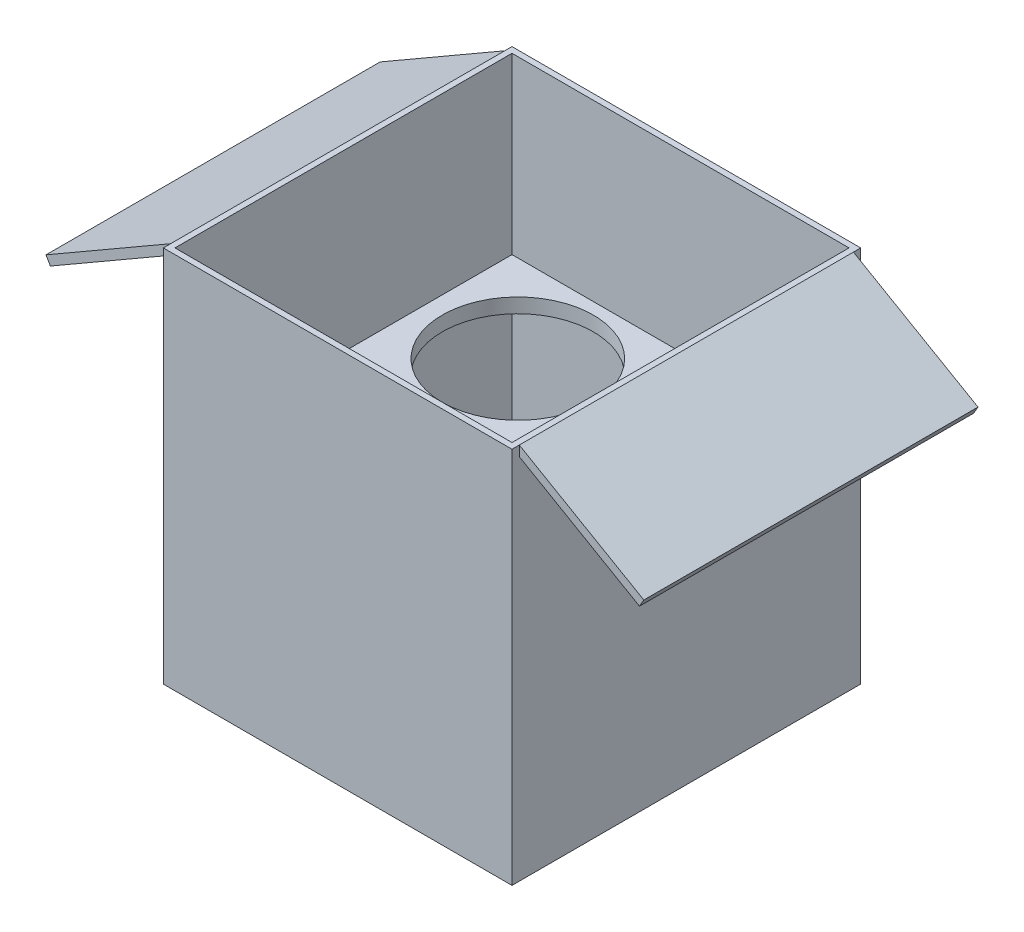
ISO-10303-21;
HEADER;
FILE_DESCRIPTION(('STEP AP214'),'2;1');
FILE_NAME('part.step','',(''),(''),'','','');
FILE_SCHEMA(('AUTOMOTIVE_DESIGN { 1 0 10303 214 1 1 1 1 }'));
ENDSEC;
DATA;
#1=APPLICATION_CONTEXT('core data for automotive mechanical design processes');
#2=APPLICATION_PROTOCOL_DEFINITION('international standard','automotive_design',2000,#1);
#3=PRODUCT_CONTEXT('',#1,'mechanical');
#4=PRODUCT('Part','Part','',(#3));
#5=PRODUCT_RELATED_PRODUCT_CATEGORY('part','',(#4));
#6=PRODUCT_DEFINITION_FORMATION('','',#4);
#7=PRODUCT_DEFINITION_CONTEXT('part definition',#1,'design');
#8=PRODUCT_DEFINITION('design','',#6,#7);
#9=PRODUCT_DEFINITION_SHAPE('','',#8);
#10=(LENGTH_UNIT() NAMED_UNIT(*) SI_UNIT(.MILLI.,.METRE.));
#11=(NAMED_UNIT(*) PLANE_ANGLE_UNIT() SI_UNIT($,.RADIAN.));
#12=(NAMED_UNIT(*) SI_UNIT($,.STERADIAN.) SOLID_ANGLE_UNIT());
#13=UNCERTAINTY_MEASURE_WITH_UNIT(LENGTH_MEASURE(1.E-05),#10,'distance_accuracy_value','');
#14=(GEOMETRIC_REPRESENTATION_CONTEXT(3) GLOBAL_UNCERTAINTY_ASSIGNED_CONTEXT((#13)) GLOBAL_UNIT_ASSIGNED_CONTEXT((#10,
#11,#12)) REPRESENTATION_CONTEXT('',''));
#15=CARTESIAN_POINT('',(0.,0.,0.));
#16=DIRECTION('',(0.,0.,1.));
#17=DIRECTION('',(1.,0.,0.));
#18=AXIS2_PLACEMENT_3D('',#15,#16,#17);
#19=CARTESIAN_POINT('',(0.,5.,0.));
#20=DIRECTION('',(0.,1.,0.));
#21=DIRECTION('',(0.,0.,1.));
#22=AXIS2_PLACEMENT_3D('',#19,#20,#21);
#23=PLANE('',#22);
#24=DIRECTION('',(0.,0.,-1.));
#25=VECTOR('',#24,1.);
#26=CARTESIAN_POINT('',(-58.,5.,0.));
#27=LINE('',#26,#25);
#28=CARTESIAN_POINT('',(-58.,5.,58.));
#29=VERTEX_POINT('',#28);
#30=CARTESIAN_POINT('',(-58.,5.,-58.));
#31=VERTEX_POINT('',#30);
#32=EDGE_CURVE('E215',#29,#31,#27,.T.);
#33=ORIENTED_EDGE('',*,*,#32,.F.);
#34=DIRECTION('',(-1.,0.,0.));
#35=VECTOR('',#34,1.);
#36=CARTESIAN_POINT('',(0.,5.,58.));
#37=LINE('',#36,#35);
#38=CARTESIAN_POINT('',(58.,5.,58.));
#39=VERTEX_POINT('',#38);
#40=EDGE_CURVE('E306',#39,#29,#37,.T.);
#41=ORIENTED_EDGE('',*,*,#40,.F.);
#42=DIRECTION('',(0.,0.,1.));
#43=VECTOR('',#42,1.);
#44=CARTESIAN_POINT('',(58.,5.,0.));
#45=LINE('',#44,#43);
#46=CARTESIAN_POINT('',(58.,5.,-58.));
#47=VERTEX_POINT('',#46);
#48=EDGE_CURVE('E302',#47,#39,#45,.T.);
#49=ORIENTED_EDGE('',*,*,#48,.F.);
#50=DIRECTION('',(1.,0.,0.));
#51=VECTOR('',#50,1.);
#52=CARTESIAN_POINT('',(0.,5.,-58.));
#53=LINE('',#52,#51);
#54=EDGE_CURVE('E298',#31,#47,#53,.T.);
#55=ORIENTED_EDGE('',*,*,#54,.F.);
#56=EDGE_LOOP('',(#33,#41,#49,#55));
#57=FACE_BOUND('',#56,.T.);
#58=ADVANCED_FACE('F71',(#57),#23,.T.);
#59=CARTESIAN_POINT('',(-58.,130.,-58.));
#60=DIRECTION('',(0.,0.,1.));
#61=DIRECTION('',(1.,0.,0.));
#62=AXIS2_PLACEMENT_3D('',#59,#60,#61);
#63=PLANE('',#62);
#64=DIRECTION('',(0.,-1.,0.));
#65=VECTOR('',#64,1.);
#66=CARTESIAN_POINT('',(58.,130.,-58.));
#67=LINE('',#66,#65);
#68=CARTESIAN_POINT('',(58.,65.,-58.));
#69=VERTEX_POINT('',#68);
#70=EDGE_CURVE('E233',#69,#47,#67,.T.);
#71=ORIENTED_EDGE('',*,*,#70,.F.);
#72=DIRECTION('',(-1.,0.,0.));
#73=VECTOR('',#72,1.);
#74=CARTESIAN_POINT('',(-58.,65.,-58.));
#75=LINE('',#74,#73);
#76=CARTESIAN_POINT('',(-58.,65.,-58.));
#77=VERTEX_POINT('',#76);
#78=EDGE_CURVE('E12',#69,#77,#75,.T.);
#79=ORIENTED_EDGE('',*,*,#78,.T.);
#80=DIRECTION('',(0.,-1.,0.));
#81=VECTOR('',#80,1.);
#82=CARTESIAN_POINT('',(-58.,130.,-58.));
#83=LINE('',#82,#81);
#84=EDGE_CURVE('E234',#77,#31,#83,.T.);
#85=ORIENTED_EDGE('',*,*,#84,.T.);
#86=ORIENTED_EDGE('',*,*,#54,.T.);
#87=EDGE_LOOP('',(#71,#79,#85,#86));
#88=FACE_BOUND('',#87,.T.);
#89=ADVANCED_FACE('F467',(#88),#63,.T.);
#90=CARTESIAN_POINT('',(58.,130.,-58.));
#91=DIRECTION('',(-1.,0.,0.));
#92=DIRECTION('',(0.,0.,1.));
#93=AXIS2_PLACEMENT_3D('',#90,#91,#92);
#94=PLANE('',#93);
#95=DIRECTION('',(0.,-1.,0.));
#96=VECTOR('',#95,1.);
#97=CARTESIAN_POINT('',(58.,130.,58.));
#98=LINE('',#97,#96);
#99=CARTESIAN_POINT('',(58.,65.,58.));
#100=VERTEX_POINT('',#99);
#101=EDGE_CURVE('E244',#100,#39,#98,.T.);
#102=ORIENTED_EDGE('',*,*,#101,.F.);
#103=DIRECTION('',(0.,0.,-1.));
#104=VECTOR('',#103,1.);
#105=CARTESIAN_POINT('',(58.,65.,-58.));
#106=LINE('',#105,#104);
#107=EDGE_CURVE('E226',#100,#69,#106,.T.);
#108=ORIENTED_EDGE('',*,*,#107,.T.);
#109=ORIENTED_EDGE('',*,*,#70,.T.);
#110=ORIENTED_EDGE('',*,*,#48,.T.);
#111=EDGE_LOOP('',(#102,#108,#109,#110));
#112=FACE_BOUND('',#111,.T.);
#113=ADVANCED_FACE('F460',(#112),#94,.T.);
#114=CARTESIAN_POINT('',(-58.,130.,58.));
#115=DIRECTION('',(0.,0.,-1.));
#116=DIRECTION('',(-1.,0.,0.));
#117=AXIS2_PLACEMENT_3D('',#114,#115,#116);
#118=PLANE('',#117);
#119=DIRECTION('',(0.,-1.,0.));
#120=VECTOR('',#119,1.);
#121=CARTESIAN_POINT('',(-58.,130.,58.));
#122=LINE('',#121,#120);
#123=CARTESIAN_POINT('',(-58.,65.,58.));
#124=VERTEX_POINT('',#123);
#125=EDGE_CURVE('E249',#124,#29,#122,.T.);
#126=ORIENTED_EDGE('',*,*,#125,.F.);
#127=DIRECTION('',(1.,0.,0.));
#128=VECTOR('',#127,1.);
#129=CARTESIAN_POINT('',(-58.,65.,58.));
#130=LINE('',#129,#128);
#131=EDGE_CURVE('E342',#124,#100,#130,.T.);
#132=ORIENTED_EDGE('',*,*,#131,.T.);
#133=ORIENTED_EDGE('',*,*,#101,.T.);
#134=ORIENTED_EDGE('',*,*,#40,.T.);
#135=EDGE_LOOP('',(#126,#132,#133,#134));
#136=FACE_BOUND('',#135,.T.);
#137=ADVANCED_FACE('F454',(#136),#118,.T.);
#138=CARTESIAN_POINT('',(-58.,130.,-58.));
#139=DIRECTION('',(1.,0.,0.));
#140=DIRECTION('',(0.,0.,-1.));
#141=AXIS2_PLACEMENT_3D('',#138,#139,#140);
#142=PLANE('',#141);
#143=ORIENTED_EDGE('',*,*,#84,.F.);
#144=DIRECTION('',(0.,0.,1.));
#145=VECTOR('',#144,1.);
#146=CARTESIAN_POINT('',(-58.,65.,-58.));
#147=LINE('',#146,#145);
#148=EDGE_CURVE('E97',#77,#124,#147,.T.);
#149=ORIENTED_EDGE('',*,*,#148,.T.);
#150=ORIENTED_EDGE('',*,*,#125,.T.);
#151=ORIENTED_EDGE('',*,*,#32,.T.);
#152=EDGE_LOOP('',(#143,#149,#150,#151));
#153=FACE_BOUND('',#152,.T.);
#154=ADVANCED_FACE('F463',(#153),#142,.T.);
#155=CARTESIAN_POINT('',(-60.,65.,180.104121494643));
#156=DIRECTION('',(0.,1.,0.));
#157=DIRECTION('',(0.,0.,1.));
#158=AXIS2_PLACEMENT_3D('',#155,#156,#157);
#159=PLANE('',#158);
#160=CARTESIAN_POINT('',(-26.,65.,-28.));
#161=DIRECTION('',(0.,1.,0.));
#162=DIRECTION('',(0.,0.,1.));
#163=AXIS2_PLACEMENT_3D('',#160,#161,#162);
#164=CIRCLE('',#163,26.);
#165=CARTESIAN_POINT('',(-26.,65.,-2.00000000000001));
#166=VERTEX_POINT('',#165);
#167=EDGE_CURVE('E75',#166,#166,#164,.T.);
#168=ORIENTED_EDGE('',*,*,#167,.T.);
#169=EDGE_LOOP('',(#168));
#170=FACE_BOUND('',#169,.T.);
#171=CARTESIAN_POINT('',(28.,65.,28.));
#172=DIRECTION('',(0.,1.,0.));
#173=DIRECTION('',(0.,0.,1.));
#174=AXIS2_PLACEMENT_3D('',#171,#172,#173);
#175=CIRCLE('',#174,26.);
#176=CARTESIAN_POINT('',(28.,65.,54.));
#177=VERTEX_POINT('',#176);
#178=EDGE_CURVE('E321',#177,#177,#175,.T.);
#179=ORIENTED_EDGE('',*,*,#178,.T.);
#180=EDGE_LOOP('',(#179));
#181=FACE_BOUND('',#180,.T.);
#182=CARTESIAN_POINT('',(-26.,65.,28.));
#183=DIRECTION('',(0.,1.,0.));
#184=DIRECTION('',(0.,0.,1.));
#185=AXIS2_PLACEMENT_3D('',#182,#183,#184);
#186=CIRCLE('',#185,26.);
#187=CARTESIAN_POINT('',(-26.,65.,54.));
#188=VERTEX_POINT('',#187);
#189=EDGE_CURVE('E317',#188,#188,#186,.T.);
#190=ORIENTED_EDGE('',*,*,#189,.T.);
#191=EDGE_LOOP('',(#190));
#192=FACE_BOUND('',#191,.T.);
#193=CARTESIAN_POINT('',(28.,65.,-28.));
#194=DIRECTION('',(0.,1.,0.));
#195=DIRECTION('',(0.,0.,1.));
#196=AXIS2_PLACEMENT_3D('',#193,#194,#195);
#197=CIRCLE('',#196,26.);
#198=CARTESIAN_POINT('',(28.,65.,-2.00000000000002));
#199=VERTEX_POINT('',#198);
#200=EDGE_CURVE('E313',#199,#199,#197,.T.);
#201=ORIENTED_EDGE('',*,*,#200,.T.);
#202=EDGE_LOOP('',(#201));
#203=FACE_BOUND('',#202,.T.);
#204=ORIENTED_EDGE('',*,*,#148,.F.);
#205=ORIENTED_EDGE('',*,*,#78,.F.);
#206=ORIENTED_EDGE('',*,*,#107,.F.);
#207=ORIENTED_EDGE('',*,*,#131,.F.);
#208=EDGE_LOOP('',(#204,#205,#206,#207));
#209=FACE_BOUND('',#208,.T.);
#210=ADVANCED_FACE('F525',(#170,#181,#192,#203,#209),#159,.F.);
#211=CARTESIAN_POINT('',(28.,60.,-28.));
#212=DIRECTION('',(0.,1.,0.));
#213=DIRECTION('',(0.,0.,1.));
#214=AXIS2_PLACEMENT_3D('',#211,#212,#213);
#215=CYLINDRICAL_SURFACE('',#214,26.);
#216=CARTESIAN_POINT('',(28.,70.,-28.));
#217=DIRECTION('',(0.,1.,0.));
#218=DIRECTION('',(0.,0.,1.));
#219=AXIS2_PLACEMENT_3D('',#216,#217,#218);
#220=CIRCLE('',#219,26.);
#221=CARTESIAN_POINT('',(28.,70.,-2.00000000000002));
#222=VERTEX_POINT('',#221);
#223=EDGE_CURVE('E318',#222,#222,#220,.T.);
#224=ORIENTED_EDGE('',*,*,#223,.T.);
#225=EDGE_LOOP('',(#224));
#226=FACE_BOUND('',#225,.T.);
#227=ORIENTED_EDGE('',*,*,#200,.F.);
#228=EDGE_LOOP('',(#227));
#229=FACE_BOUND('',#228,.T.);
#230=ADVANCED_FACE('F529',(#226,#229),#215,.F.);
#231=CARTESIAN_POINT('',(-26.,60.,28.));
#232=DIRECTION('',(0.,1.,0.));
#233=DIRECTION('',(0.,0.,1.));
#234=AXIS2_PLACEMENT_3D('',#231,#232,#233);
#235=CYLINDRICAL_SURFACE('',#234,26.);
#236=CARTESIAN_POINT('',(-26.,70.,28.));
#237=DIRECTION('',(0.,1.,0.));
#238=DIRECTION('',(0.,0.,-1.));
#239=AXIS2_PLACEMENT_3D('',#236,#237,#238);
#240=CIRCLE('',#239,26.);
#241=CARTESIAN_POINT('',(-26.,70.,2.00000000000001));
#242=VERTEX_POINT('',#241);
#243=EDGE_CURVE('E916',#242,#242,#240,.T.);
#244=ORIENTED_EDGE('',*,*,#243,.T.);
#245=EDGE_LOOP('',(#244));
#246=FACE_BOUND('',#245,.T.);
#247=ORIENTED_EDGE('',*,*,#189,.F.);
#248=EDGE_LOOP('',(#247));
#249=FACE_BOUND('',#248,.T.);
#250=ADVANCED_FACE('F534',(#246,#249),#235,.F.);
#251=CARTESIAN_POINT('',(28.,60.,28.));
#252=DIRECTION('',(0.,1.,0.));
#253=DIRECTION('',(0.,0.,1.));
#254=AXIS2_PLACEMENT_3D('',#251,#252,#253);
#255=CYLINDRICAL_SURFACE('',#254,26.);
#256=CARTESIAN_POINT('',(28.,70.,28.));
#257=DIRECTION('',(0.,1.,0.));
#258=DIRECTION('',(0.,0.,-1.));
#259=AXIS2_PLACEMENT_3D('',#256,#257,#258);
#260=CIRCLE('',#259,26.);
#261=CARTESIAN_POINT('',(28.,70.,2.00000000000002));
#262=VERTEX_POINT('',#261);
#263=EDGE_CURVE('E910',#262,#262,#260,.T.);
#264=ORIENTED_EDGE('',*,*,#263,.T.);
#265=EDGE_LOOP('',(#264));
#266=FACE_BOUND('',#265,.T.);
#267=ORIENTED_EDGE('',*,*,#178,.F.);
#268=EDGE_LOOP('',(#267));
#269=FACE_BOUND('',#268,.T.);
#270=ADVANCED_FACE('F613',(#266,#269),#255,.F.);
#271=CARTESIAN_POINT('',(-26.,60.,-28.));
#272=DIRECTION('',(0.,1.,0.));
#273=DIRECTION('',(0.,0.,1.));
#274=AXIS2_PLACEMENT_3D('',#271,#272,#273);
#275=CYLINDRICAL_SURFACE('',#274,26.);
#276=CARTESIAN_POINT('',(-26.,70.,-28.));
#277=DIRECTION('',(0.,1.,0.));
#278=DIRECTION('',(0.,0.,1.));
#279=AXIS2_PLACEMENT_3D('',#276,#277,#278);
#280=CIRCLE('',#279,26.);
#281=CARTESIAN_POINT('',(-26.,70.,-2.00000000000001));
#282=VERTEX_POINT('',#281);
#283=EDGE_CURVE('E908',#282,#282,#280,.T.);
#284=ORIENTED_EDGE('',*,*,#283,.T.);
#285=EDGE_LOOP('',(#284));
#286=FACE_BOUND('',#285,.T.);
#287=ORIENTED_EDGE('',*,*,#167,.F.);
#288=EDGE_LOOP('',(#287));
#289=FACE_BOUND('',#288,.T.);
#290=ADVANCED_FACE('F461',(#286,#289),#275,.F.);
#291=CARTESIAN_POINT('',(-58.,130.,58.));
#292=VERTEX_POINT('',#291);
#293=CARTESIAN_POINT('',(-58.,70.,58.));
#294=VERTEX_POINT('',#293);
#295=EDGE_CURVE('E224',#292,#294,#122,.T.);
#296=ORIENTED_EDGE('',*,*,#295,.T.);
#297=DIRECTION('',(0.,0.,-1.));
#298=VECTOR('',#297,1.);
#299=CARTESIAN_POINT('',(-58.,70.,-58.));
#300=LINE('',#299,#298);
#301=CARTESIAN_POINT('',(-58.,70.,-58.));
#302=VERTEX_POINT('',#301);
#303=EDGE_CURVE('E209',#294,#302,#300,.T.);
#304=ORIENTED_EDGE('',*,*,#303,.T.);
#305=CARTESIAN_POINT('',(-58.,130.,-58.));
#306=VERTEX_POINT('',#305);
#307=EDGE_CURVE('E221',#306,#302,#83,.T.);
#308=ORIENTED_EDGE('',*,*,#307,.F.);
#309=DIRECTION('',(0.,0.,1.));
#310=VECTOR('',#309,1.);
#311=CARTESIAN_POINT('',(-58.,130.,-58.));
#312=LINE('',#311,#310);
#313=EDGE_CURVE('E436',#306,#292,#312,.T.);
#314=ORIENTED_EDGE('',*,*,#313,.T.);
#315=EDGE_LOOP('',(#296,#304,#308,#314));
#316=FACE_BOUND('',#315,.T.);
#317=ADVANCED_FACE('F220',(#316),#142,.T.);
#318=CARTESIAN_POINT('',(58.,130.,58.));
#319=VERTEX_POINT('',#318);
#320=CARTESIAN_POINT('',(58.,70.,58.));
#321=VERTEX_POINT('',#320);
#322=EDGE_CURVE('E245',#319,#321,#98,.T.);
#323=ORIENTED_EDGE('',*,*,#322,.T.);
#324=DIRECTION('',(-1.,0.,0.));
#325=VECTOR('',#324,1.);
#326=CARTESIAN_POINT('',(-58.,70.,58.));
#327=LINE('',#326,#325);
#328=EDGE_CURVE('E227',#321,#294,#327,.T.);
#329=ORIENTED_EDGE('',*,*,#328,.T.);
#330=ORIENTED_EDGE('',*,*,#295,.F.);
#331=DIRECTION('',(1.,0.,0.));
#332=VECTOR('',#331,1.);
#333=CARTESIAN_POINT('',(-58.,130.,58.));
#334=LINE('',#333,#332);
#335=EDGE_CURVE('E439',#292,#319,#334,.T.);
#336=ORIENTED_EDGE('',*,*,#335,.T.);
#337=EDGE_LOOP('',(#323,#329,#330,#336));
#338=FACE_BOUND('',#337,.T.);
#339=ADVANCED_FACE('F451',(#338),#118,.T.);
#340=CARTESIAN_POINT('',(58.,130.,-58.));
#341=VERTEX_POINT('',#340);
#342=CARTESIAN_POINT('',(58.,70.,-58.));
#343=VERTEX_POINT('',#342);
#344=EDGE_CURVE('E238',#341,#343,#67,.T.);
#345=ORIENTED_EDGE('',*,*,#344,.T.);
#346=DIRECTION('',(0.,0.,1.));
#347=VECTOR('',#346,1.);
#348=CARTESIAN_POINT('',(58.,70.,-58.));
#349=LINE('',#348,#347);
#350=EDGE_CURVE('E89',#343,#321,#349,.T.);
#351=ORIENTED_EDGE('',*,*,#350,.T.);
#352=ORIENTED_EDGE('',*,*,#322,.F.);
#353=DIRECTION('',(0.,0.,-1.));
#354=VECTOR('',#353,1.);
#355=CARTESIAN_POINT('',(58.,130.,-58.));
#356=LINE('',#355,#354);
#357=EDGE_CURVE('E441',#319,#341,#356,.T.);
#358=ORIENTED_EDGE('',*,*,#357,.T.);
#359=EDGE_LOOP('',(#345,#351,#352,#358));
#360=FACE_BOUND('',#359,.T.);
#361=ADVANCED_FACE('F446',(#360),#94,.T.);
#362=ORIENTED_EDGE('',*,*,#307,.T.);
#363=DIRECTION('',(1.,0.,0.));
#364=VECTOR('',#363,1.);
#365=CARTESIAN_POINT('',(-58.,70.,-58.));
#366=LINE('',#365,#364);
#367=EDGE_CURVE('E81',#302,#343,#366,.T.);
#368=ORIENTED_EDGE('',*,*,#367,.T.);
#369=ORIENTED_EDGE('',*,*,#344,.F.);
#370=DIRECTION('',(-1.,0.,0.));
#371=VECTOR('',#370,1.);
#372=CARTESIAN_POINT('',(-58.,130.,-58.));
#373=LINE('',#372,#371);
#374=EDGE_CURVE('E231',#341,#306,#373,.T.);
#375=ORIENTED_EDGE('',*,*,#374,.T.);
#376=EDGE_LOOP('',(#362,#368,#369,#375));
#377=FACE_BOUND('',#376,.T.);
#378=ADVANCED_FACE('F229',(#377),#63,.T.);
#379=CARTESIAN_POINT('',(-60.,5.,0.));
#380=DIRECTION('',(1.,0.,0.));
#381=DIRECTION('',(0.,0.,-1.));
#382=AXIS2_PLACEMENT_3D('',#379,#380,#381);
#383=PLANE('',#382);
#384=DIRECTION('',(0.,0.,1.));
#385=VECTOR('',#384,1.);
#386=CARTESIAN_POINT('',(-60.,0.,0.));
#387=LINE('',#386,#385);
#388=CARTESIAN_POINT('',(-60.,0.,-60.));
#389=VERTEX_POINT('',#388);
#390=CARTESIAN_POINT('',(-60.,0.,60.));
#391=VERTEX_POINT('',#390);
#392=EDGE_CURVE('E278',#389,#391,#387,.T.);
#393=ORIENTED_EDGE('',*,*,#392,.T.);
#394=DIRECTION('',(0.,-1.,0.));
#395=VECTOR('',#394,1.);
#396=CARTESIAN_POINT('',(-60.,5.,60.));
#397=LINE('',#396,#395);
#398=CARTESIAN_POINT('',(-60.,130.,60.));
#399=VERTEX_POINT('',#398);
#400=EDGE_CURVE('E289',#399,#391,#397,.T.);
#401=ORIENTED_EDGE('',*,*,#400,.F.);
#402=DIRECTION('',(0.,0.,1.));
#403=VECTOR('',#402,1.);
#404=CARTESIAN_POINT('',(-60.,130.,-60.));
#405=LINE('',#404,#403);
#406=CARTESIAN_POINT('',(-60.,130.,57.5));
#407=VERTEX_POINT('',#406);
#408=EDGE_CURVE('E261',#407,#399,#405,.T.);
#409=ORIENTED_EDGE('',*,*,#408,.F.);
#410=DIRECTION('',(0.,-1.,0.));
#411=VECTOR('',#410,1.);
#412=CARTESIAN_POINT('',(-60.,126.535898384862,57.5));
#413=LINE('',#412,#411);
#414=CARTESIAN_POINT('',(-60.,126.535898384862,57.5));
#415=VERTEX_POINT('',#414);
#416=EDGE_CURVE('E349',#407,#415,#413,.T.);
#417=ORIENTED_EDGE('',*,*,#416,.T.);
#418=DIRECTION('',(0.,0.,-1.));
#419=VECTOR('',#418,1.);
#420=CARTESIAN_POINT('',(-60.,126.535898384862,57.5));
#421=LINE('',#420,#419);
#422=CARTESIAN_POINT('',(-60.,126.535898384862,-57.5));
#423=VERTEX_POINT('',#422);
#424=EDGE_CURVE('E366',#415,#423,#421,.T.);
#425=ORIENTED_EDGE('',*,*,#424,.T.);
#426=DIRECTION('',(0.,-1.,0.));
#427=VECTOR('',#426,1.);
#428=CARTESIAN_POINT('',(-60.,126.535898384862,-57.5));
#429=LINE('',#428,#427);
#430=CARTESIAN_POINT('',(-60.,130.,-57.5));
#431=VERTEX_POINT('',#430);
#432=EDGE_CURVE('E348',#431,#423,#429,.T.);
#433=ORIENTED_EDGE('',*,*,#432,.F.);
#434=CARTESIAN_POINT('',(-60.,130.,-60.));
#435=VERTEX_POINT('',#434);
#436=EDGE_CURVE('E262',#435,#431,#405,.T.);
#437=ORIENTED_EDGE('',*,*,#436,.F.);
#438=DIRECTION('',(0.,-1.,0.));
#439=VECTOR('',#438,1.);
#440=CARTESIAN_POINT('',(-60.,5.,-60.));
#441=LINE('',#440,#439);
#442=EDGE_CURVE('E292',#435,#389,#441,.T.);
#443=ORIENTED_EDGE('',*,*,#442,.T.);
#444=EDGE_LOOP('',(#393,#401,#409,#417,#425,#433,#437,#443));
#445=FACE_BOUND('',#444,.T.);
#446=ADVANCED_FACE('F487',(#445),#383,.F.);
#447=CARTESIAN_POINT('',(60.,5.,0.));
#448=DIRECTION('',(1.,0.,0.));
#449=DIRECTION('',(0.,0.,-1.));
#450=AXIS2_PLACEMENT_3D('',#447,#448,#449);
#451=PLANE('',#450);
#452=DIRECTION('',(0.,-1.,0.));
#453=VECTOR('',#452,1.);
#454=CARTESIAN_POINT('',(60.,5.,60.));
#455=LINE('',#454,#453);
#456=CARTESIAN_POINT('',(60.,130.,60.));
#457=VERTEX_POINT('',#456);
#458=CARTESIAN_POINT('',(60.,0.,60.));
#459=VERTEX_POINT('',#458);
#460=EDGE_CURVE('E286',#457,#459,#455,.T.);
#461=ORIENTED_EDGE('',*,*,#460,.T.);
#462=DIRECTION('',(0.,0.,1.));
#463=VECTOR('',#462,1.);
#464=CARTESIAN_POINT('',(60.,0.,0.));
#465=LINE('',#464,#463);
#466=CARTESIAN_POINT('',(60.,0.,-60.));
#467=VERTEX_POINT('',#466);
#468=EDGE_CURVE('E270',#467,#459,#465,.T.);
#469=ORIENTED_EDGE('',*,*,#468,.F.);
#470=DIRECTION('',(0.,-1.,0.));
#471=VECTOR('',#470,1.);
#472=CARTESIAN_POINT('',(60.,5.,-60.));
#473=LINE('',#472,#471);
#474=CARTESIAN_POINT('',(60.,130.,-60.));
#475=VERTEX_POINT('',#474);
#476=EDGE_CURVE('E295',#475,#467,#473,.T.);
#477=ORIENTED_EDGE('',*,*,#476,.F.);
#478=DIRECTION('',(0.,0.,-1.));
#479=VECTOR('',#478,1.);
#480=CARTESIAN_POINT('',(60.,130.,-60.));
#481=LINE('',#480,#479);
#482=CARTESIAN_POINT('',(60.,130.,-57.5));
#483=VERTEX_POINT('',#482);
#484=EDGE_CURVE('E252',#483,#475,#481,.T.);
#485=ORIENTED_EDGE('',*,*,#484,.F.);
#486=DIRECTION('',(0.,-1.,0.));
#487=VECTOR('',#486,1.);
#488=CARTESIAN_POINT('',(60.,126.535898384862,-57.5));
#489=LINE('',#488,#487);
#490=CARTESIAN_POINT('',(60.,126.535898384862,-57.5));
#491=VERTEX_POINT('',#490);
#492=EDGE_CURVE('E393',#483,#491,#489,.T.);
#493=ORIENTED_EDGE('',*,*,#492,.T.);
#494=DIRECTION('',(0.,0.,-1.));
#495=VECTOR('',#494,1.);
#496=CARTESIAN_POINT('',(60.,126.535898384862,57.5));
#497=LINE('',#496,#495);
#498=CARTESIAN_POINT('',(60.,126.535898384862,57.5));
#499=VERTEX_POINT('',#498);
#500=EDGE_CURVE('E432',#499,#491,#497,.T.);
#501=ORIENTED_EDGE('',*,*,#500,.F.);
#502=DIRECTION('',(0.,-1.,0.));
#503=VECTOR('',#502,1.);
#504=CARTESIAN_POINT('',(60.,126.535898384862,57.5));
#505=LINE('',#504,#503);
#506=CARTESIAN_POINT('',(60.,130.,57.5));
#507=VERTEX_POINT('',#506);
#508=EDGE_CURVE('E394',#507,#499,#505,.T.);
#509=ORIENTED_EDGE('',*,*,#508,.F.);
#510=EDGE_CURVE('E253',#457,#507,#481,.T.);
#511=ORIENTED_EDGE('',*,*,#510,.F.);
#512=EDGE_LOOP('',(#461,#469,#477,#485,#493,#501,#509,#511));
#513=FACE_BOUND('',#512,.T.);
#514=ADVANCED_FACE('F73',(#513),#451,.T.);
#515=CARTESIAN_POINT('',(0.,5.,-60.));
#516=DIRECTION('',(0.,0.,-1.));
#517=DIRECTION('',(-1.,0.,0.));
#518=AXIS2_PLACEMENT_3D('',#515,#516,#517);
#519=PLANE('',#518);
#520=DIRECTION('',(1.,0.,0.));
#521=VECTOR('',#520,1.);
#522=CARTESIAN_POINT('',(0.,0.,-60.));
#523=LINE('',#522,#521);
#524=EDGE_CURVE('E274',#389,#467,#523,.T.);
#525=ORIENTED_EDGE('',*,*,#524,.F.);
#526=ORIENTED_EDGE('',*,*,#442,.F.);
#527=DIRECTION('',(-1.,0.,0.));
#528=VECTOR('',#527,1.);
#529=CARTESIAN_POINT('',(-60.,130.,-60.));
#530=LINE('',#529,#528);
#531=EDGE_CURVE('E257',#475,#435,#530,.T.);
#532=ORIENTED_EDGE('',*,*,#531,.F.);
#533=ORIENTED_EDGE('',*,*,#476,.T.);
#534=EDGE_LOOP('',(#525,#526,#532,#533));
#535=FACE_BOUND('',#534,.T.);
#536=ADVANCED_FACE('F485',(#535),#519,.T.);
#537=CARTESIAN_POINT('',(0.,5.,60.));
#538=DIRECTION('',(0.,0.,-1.));
#539=DIRECTION('',(-1.,0.,0.));
#540=AXIS2_PLACEMENT_3D('',#537,#538,#539);
#541=PLANE('',#540);
#542=ORIENTED_EDGE('',*,*,#400,.T.);
#543=DIRECTION('',(1.,0.,0.));
#544=VECTOR('',#543,1.);
#545=CARTESIAN_POINT('',(0.,0.,60.));
#546=LINE('',#545,#544);
#547=EDGE_CURVE('E282',#391,#459,#546,.T.);
#548=ORIENTED_EDGE('',*,*,#547,.T.);
#549=ORIENTED_EDGE('',*,*,#460,.F.);
#550=DIRECTION('',(1.,0.,0.));
#551=VECTOR('',#550,1.);
#552=CARTESIAN_POINT('',(-60.,130.,60.));
#553=LINE('',#552,#551);
#554=EDGE_CURVE('E266',#399,#457,#553,.T.);
#555=ORIENTED_EDGE('',*,*,#554,.F.);
#556=EDGE_LOOP('',(#542,#548,#549,#555));
#557=FACE_BOUND('',#556,.T.);
#558=ADVANCED_FACE('F481',(#557),#541,.F.);
#559=CARTESIAN_POINT('',(0.,0.,0.));
#560=DIRECTION('',(0.,1.,0.));
#561=DIRECTION('',(0.,0.,1.));
#562=AXIS2_PLACEMENT_3D('',#559,#560,#561);
#563=PLANE('',#562);
#564=ORIENTED_EDGE('',*,*,#468,.T.);
#565=ORIENTED_EDGE('',*,*,#547,.F.);
#566=ORIENTED_EDGE('',*,*,#392,.F.);
#567=ORIENTED_EDGE('',*,*,#524,.T.);
#568=EDGE_LOOP('',(#564,#565,#566,#567));
#569=FACE_BOUND('',#568,.T.);
#570=ADVANCED_FACE('F478',(#569),#563,.F.);
#571=CARTESIAN_POINT('',(0.,130.,0.));
#572=DIRECTION('',(0.,1.,0.));
#573=DIRECTION('',(0.,0.,1.));
#574=AXIS2_PLACEMENT_3D('',#571,#572,#573);
#575=PLANE('',#574);
#576=ORIENTED_EDGE('',*,*,#510,.T.);
#577=DIRECTION('',(0.,0.,-1.));
#578=VECTOR('',#577,1.);
#579=CARTESIAN_POINT('',(60.,130.,57.5));
#580=LINE('',#579,#578);
#581=EDGE_CURVE('E409',#507,#483,#580,.T.);
#582=ORIENTED_EDGE('',*,*,#581,.T.);
#583=ORIENTED_EDGE('',*,*,#484,.T.);
#584=ORIENTED_EDGE('',*,*,#531,.T.);
#585=ORIENTED_EDGE('',*,*,#436,.T.);
#586=DIRECTION('',(0.,0.,-1.));
#587=VECTOR('',#586,1.);
#588=CARTESIAN_POINT('',(-60.,130.,57.5));
#589=LINE('',#588,#587);
#590=EDGE_CURVE('E390',#407,#431,#589,.T.);
#591=ORIENTED_EDGE('',*,*,#590,.F.);
#592=ORIENTED_EDGE('',*,*,#408,.T.);
#593=ORIENTED_EDGE('',*,*,#554,.T.);
#594=EDGE_LOOP('',(#576,#582,#583,#584,#585,#591,#592,#593));
#595=FACE_BOUND('',#594,.T.);
#596=ORIENTED_EDGE('',*,*,#335,.F.);
#597=ORIENTED_EDGE('',*,*,#313,.F.);
#598=ORIENTED_EDGE('',*,*,#374,.F.);
#599=ORIENTED_EDGE('',*,*,#357,.F.);
#600=EDGE_LOOP('',(#596,#597,#598,#599));
#601=FACE_BOUND('',#600,.T.);
#602=ADVANCED_FACE('F449',(#595,#601),#575,.T.);
#603=CARTESIAN_POINT('',(101.36825748733,102.651923788647,57.5));
#604=DIRECTION('',(0.499999999999998,0.86602540378444,0.));
#605=DIRECTION('',(-0.86602540378444,0.499999999999998,0.));
#606=AXIS2_PLACEMENT_3D('',#603,#604,#605);
#607=PLANE('',#606);
#608=DIRECTION('',(0.86602540378444,-0.499999999999998,0.));
#609=VECTOR('',#608,1.);
#610=CARTESIAN_POINT('',(101.36825748733,102.651923788647,-57.5));
#611=LINE('',#610,#609);
#612=CARTESIAN_POINT('',(101.36825748733,102.651923788647,-57.5));
#613=VERTEX_POINT('',#612);
#614=EDGE_CURVE('E412',#491,#613,#611,.T.);
#615=ORIENTED_EDGE('',*,*,#614,.T.);
#616=DIRECTION('',(0.,0.,-1.));
#617=VECTOR('',#616,1.);
#618=CARTESIAN_POINT('',(101.36825748733,102.651923788647,57.5));
#619=LINE('',#618,#617);
#620=CARTESIAN_POINT('',(101.36825748733,102.651923788647,57.5));
#621=VERTEX_POINT('',#620);
#622=EDGE_CURVE('E428',#621,#613,#619,.T.);
#623=ORIENTED_EDGE('',*,*,#622,.F.);
#624=DIRECTION('',(0.86602540378444,-0.499999999999998,0.));
#625=VECTOR('',#624,1.);
#626=CARTESIAN_POINT('',(101.36825748733,102.651923788647,57.5));
#627=LINE('',#626,#625);
#628=EDGE_CURVE('E398',#499,#621,#627,.T.);
#629=ORIENTED_EDGE('',*,*,#628,.F.);
#630=ORIENTED_EDGE('',*,*,#500,.T.);
#631=EDGE_LOOP('',(#615,#623,#629,#630));
#632=FACE_BOUND('',#631,.T.);
#633=ADVANCED_FACE('F577',(#632),#607,.F.);
#634=CARTESIAN_POINT('',(102.86825748733,105.25,57.5));
#635=DIRECTION('',(-0.866025403784435,0.500000000000006,0.));
#636=DIRECTION('',(-0.500000000000006,-0.866025403784435,0.));
#637=AXIS2_PLACEMENT_3D('',#634,#635,#636);
#638=PLANE('',#637);
#639=DIRECTION('',(0.500000000000006,0.866025403784435,0.));
#640=VECTOR('',#639,1.);
#641=CARTESIAN_POINT('',(102.86825748733,105.25,-57.5));
#642=LINE('',#641,#640);
#643=CARTESIAN_POINT('',(102.86825748733,105.25,-57.5));
#644=VERTEX_POINT('',#643);
#645=EDGE_CURVE('E415',#613,#644,#642,.T.);
#646=ORIENTED_EDGE('',*,*,#645,.T.);
#647=DIRECTION('',(0.,0.,-1.));
#648=VECTOR('',#647,1.);
#649=CARTESIAN_POINT('',(102.86825748733,105.25,57.5));
#650=LINE('',#649,#648);
#651=CARTESIAN_POINT('',(102.86825748733,105.25,57.5));
#652=VERTEX_POINT('',#651);
#653=EDGE_CURVE('E424',#652,#644,#650,.T.);
#654=ORIENTED_EDGE('',*,*,#653,.F.);
#655=DIRECTION('',(0.500000000000006,0.866025403784435,0.));
#656=VECTOR('',#655,1.);
#657=CARTESIAN_POINT('',(102.86825748733,105.25,57.5));
#658=LINE('',#657,#656);
#659=EDGE_CURVE('E402',#621,#652,#658,.T.);
#660=ORIENTED_EDGE('',*,*,#659,.F.);
#661=ORIENTED_EDGE('',*,*,#622,.T.);
#662=EDGE_LOOP('',(#646,#654,#660,#661));
#663=FACE_BOUND('',#662,.T.);
#664=ADVANCED_FACE('F573',(#663),#638,.F.);
#665=CARTESIAN_POINT('',(60.,130.,57.5));
#666=DIRECTION('',(-0.499999999999998,-0.86602540378444,0.));
#667=DIRECTION('',(0.86602540378444,-0.499999999999998,0.));
#668=AXIS2_PLACEMENT_3D('',#665,#666,#667);
#669=PLANE('',#668);
#670=DIRECTION('',(-0.86602540378444,0.499999999999998,0.));
#671=VECTOR('',#670,1.);
#672=CARTESIAN_POINT('',(60.,130.,-57.5));
#673=LINE('',#672,#671);
#674=EDGE_CURVE('E399',#644,#483,#673,.T.);
#675=ORIENTED_EDGE('',*,*,#674,.T.);
#676=ORIENTED_EDGE('',*,*,#581,.F.);
#677=DIRECTION('',(-0.86602540378444,0.499999999999998,0.));
#678=VECTOR('',#677,1.);
#679=CARTESIAN_POINT('',(60.,130.,57.5));
#680=LINE('',#679,#678);
#681=EDGE_CURVE('E405',#652,#507,#680,.T.);
#682=ORIENTED_EDGE('',*,*,#681,.F.);
#683=ORIENTED_EDGE('',*,*,#653,.T.);
#684=EDGE_LOOP('',(#675,#676,#682,#683));
#685=FACE_BOUND('',#684,.T.);
#686=ADVANCED_FACE('F566',(#685),#669,.F.);
#687=CARTESIAN_POINT('',(0.,0.,57.5));
#688=DIRECTION('',(0.,0.,-1.));
#689=DIRECTION('',(-1.,0.,0.));
#690=AXIS2_PLACEMENT_3D('',#687,#688,#689);
#691=PLANE('',#690);
#692=ORIENTED_EDGE('',*,*,#508,.T.);
#693=ORIENTED_EDGE('',*,*,#628,.T.);
#694=ORIENTED_EDGE('',*,*,#659,.T.);
#695=ORIENTED_EDGE('',*,*,#681,.T.);
#696=EDGE_LOOP('',(#692,#693,#694,#695));
#697=FACE_BOUND('',#696,.T.);
#698=ADVANCED_FACE('F563',(#697),#691,.F.);
#699=CARTESIAN_POINT('',(0.,0.,-57.5));
#700=DIRECTION('',(0.,0.,-1.));
#701=DIRECTION('',(-1.,0.,0.));
#702=AXIS2_PLACEMENT_3D('',#699,#700,#701);
#703=PLANE('',#702);
#704=ORIENTED_EDGE('',*,*,#492,.F.);
#705=ORIENTED_EDGE('',*,*,#674,.F.);
#706=ORIENTED_EDGE('',*,*,#645,.F.);
#707=ORIENTED_EDGE('',*,*,#614,.F.);
#708=EDGE_LOOP('',(#704,#705,#706,#707));
#709=FACE_BOUND('',#708,.T.);
#710=ADVANCED_FACE('F561',(#709),#703,.T.);
#711=CARTESIAN_POINT('',(-60.,130.,57.5));
#712=DIRECTION('',(-0.499999999999998,0.86602540378444,0.));
#713=DIRECTION('',(-0.86602540378444,-0.499999999999998,0.));
#714=AXIS2_PLACEMENT_3D('',#711,#712,#713);
#715=PLANE('',#714);
#716=DIRECTION('',(0.86602540378444,0.499999999999998,0.));
#717=VECTOR('',#716,1.);
#718=CARTESIAN_POINT('',(-60.,130.,-57.5));
#719=LINE('',#718,#717);
#720=CARTESIAN_POINT('',(-102.86825748733,105.25,-57.5));
#721=VERTEX_POINT('',#720);
#722=EDGE_CURVE('E370',#721,#431,#719,.T.);
#723=ORIENTED_EDGE('',*,*,#722,.F.);
#724=DIRECTION('',(0.,0.,-1.));
#725=VECTOR('',#724,1.);
#726=CARTESIAN_POINT('',(-102.86825748733,105.25,57.5));
#727=LINE('',#726,#725);
#728=CARTESIAN_POINT('',(-102.86825748733,105.25,57.5));
#729=VERTEX_POINT('',#728);
#730=EDGE_CURVE('E387',#729,#721,#727,.T.);
#731=ORIENTED_EDGE('',*,*,#730,.F.);
#732=DIRECTION('',(0.86602540378444,0.499999999999998,0.));
#733=VECTOR('',#732,1.);
#734=CARTESIAN_POINT('',(-60.,130.,57.5));
#735=LINE('',#734,#733);
#736=EDGE_CURVE('E353',#729,#407,#735,.T.);
#737=ORIENTED_EDGE('',*,*,#736,.T.);
#738=ORIENTED_EDGE('',*,*,#590,.T.);
#739=EDGE_LOOP('',(#723,#731,#737,#738));
#740=FACE_BOUND('',#739,.T.);
#741=ADVANCED_FACE('F557',(#740),#715,.T.);
#742=CARTESIAN_POINT('',(-102.86825748733,105.25,57.5));
#743=DIRECTION('',(-0.866025403784435,-0.500000000000006,0.));
#744=DIRECTION('',(0.500000000000006,-0.866025403784435,0.));
#745=AXIS2_PLACEMENT_3D('',#742,#743,#744);
#746=PLANE('',#745);
#747=DIRECTION('',(-0.500000000000006,0.866025403784435,0.));
#748=VECTOR('',#747,1.);
#749=CARTESIAN_POINT('',(-102.86825748733,105.25,-57.5));
#750=LINE('',#749,#748);
#751=CARTESIAN_POINT('',(-101.36825748733,102.651923788647,-57.5));
#752=VERTEX_POINT('',#751);
#753=EDGE_CURVE('E374',#752,#721,#750,.T.);
#754=ORIENTED_EDGE('',*,*,#753,.F.);
#755=DIRECTION('',(0.,0.,-1.));
#756=VECTOR('',#755,1.);
#757=CARTESIAN_POINT('',(-101.36825748733,102.651923788647,57.5));
#758=LINE('',#757,#756);
#759=CARTESIAN_POINT('',(-101.36825748733,102.651923788647,57.5));
#760=VERTEX_POINT('',#759);
#761=EDGE_CURVE('E384',#760,#752,#758,.T.);
#762=ORIENTED_EDGE('',*,*,#761,.F.);
#763=DIRECTION('',(-0.500000000000006,0.866025403784435,0.));
#764=VECTOR('',#763,1.);
#765=CARTESIAN_POINT('',(-102.86825748733,105.25,57.5));
#766=LINE('',#765,#764);
#767=EDGE_CURVE('E358',#760,#729,#766,.T.);
#768=ORIENTED_EDGE('',*,*,#767,.T.);
#769=ORIENTED_EDGE('',*,*,#730,.T.);
#770=EDGE_LOOP('',(#754,#762,#768,#769));
#771=FACE_BOUND('',#770,.T.);
#772=ADVANCED_FACE('F553',(#771),#746,.T.);
#773=CARTESIAN_POINT('',(-101.36825748733,102.651923788647,57.5));
#774=DIRECTION('',(0.499999999999998,-0.86602540378444,0.));
#775=DIRECTION('',(0.86602540378444,0.499999999999998,0.));
#776=AXIS2_PLACEMENT_3D('',#773,#774,#775);
#777=PLANE('',#776);
#778=DIRECTION('',(-0.86602540378444,-0.499999999999998,0.));
#779=VECTOR('',#778,1.);
#780=CARTESIAN_POINT('',(-101.36825748733,102.651923788647,-57.5));
#781=LINE('',#780,#779);
#782=EDGE_CURVE('E354',#423,#752,#781,.T.);
#783=ORIENTED_EDGE('',*,*,#782,.F.);
#784=ORIENTED_EDGE('',*,*,#424,.F.);
#785=DIRECTION('',(-0.86602540378444,-0.499999999999998,0.));
#786=VECTOR('',#785,1.);
#787=CARTESIAN_POINT('',(-101.36825748733,102.651923788647,57.5));
#788=LINE('',#787,#786);
#789=EDGE_CURVE('E362',#415,#760,#788,.T.);
#790=ORIENTED_EDGE('',*,*,#789,.T.);
#791=ORIENTED_EDGE('',*,*,#761,.T.);
#792=EDGE_LOOP('',(#783,#784,#790,#791));
#793=FACE_BOUND('',#792,.T.);
#794=ADVANCED_FACE('F546',(#793),#777,.T.);
#795=CARTESIAN_POINT('',(0.,0.,57.5));
#796=DIRECTION('',(0.,0.,-1.));
#797=DIRECTION('',(1.,0.,0.));
#798=AXIS2_PLACEMENT_3D('',#795,#796,#797);
#799=PLANE('',#798);
#800=ORIENTED_EDGE('',*,*,#416,.F.);
#801=ORIENTED_EDGE('',*,*,#736,.F.);
#802=ORIENTED_EDGE('',*,*,#767,.F.);
#803=ORIENTED_EDGE('',*,*,#789,.F.);
#804=EDGE_LOOP('',(#800,#801,#802,#803));
#805=FACE_BOUND('',#804,.T.);
#806=ADVANCED_FACE('F543',(#805),#799,.F.);
#807=CARTESIAN_POINT('',(0.,0.,-57.5));
#808=DIRECTION('',(0.,0.,-1.));
#809=DIRECTION('',(1.,0.,0.));
#810=AXIS2_PLACEMENT_3D('',#807,#808,#809);
#811=PLANE('',#810);
#812=ORIENTED_EDGE('',*,*,#432,.T.);
#813=ORIENTED_EDGE('',*,*,#782,.T.);
#814=ORIENTED_EDGE('',*,*,#753,.T.);
#815=ORIENTED_EDGE('',*,*,#722,.T.);
#816=EDGE_LOOP('',(#812,#813,#814,#815));
#817=FACE_BOUND('',#816,.T.);
#818=ADVANCED_FACE('F541',(#817),#811,.T.);
#819=CARTESIAN_POINT('',(-60.,70.,180.104121494643));
#820=DIRECTION('',(0.,-1.,0.));
#821=DIRECTION('',(0.,0.,-1.));
#822=AXIS2_PLACEMENT_3D('',#819,#820,#821);
#823=PLANE('',#822);
#824=ORIENTED_EDGE('',*,*,#283,.F.);
#825=EDGE_LOOP('',(#824));
#826=FACE_BOUND('',#825,.T.);
#827=ORIENTED_EDGE('',*,*,#263,.F.);
#828=EDGE_LOOP('',(#827));
#829=FACE_BOUND('',#828,.T.);
#830=ORIENTED_EDGE('',*,*,#243,.F.);
#831=EDGE_LOOP('',(#830));
#832=FACE_BOUND('',#831,.T.);
#833=ORIENTED_EDGE('',*,*,#223,.F.);
#834=EDGE_LOOP('',(#833));
#835=FACE_BOUND('',#834,.T.);
#836=ORIENTED_EDGE('',*,*,#303,.F.);
#837=ORIENTED_EDGE('',*,*,#328,.F.);
#838=ORIENTED_EDGE('',*,*,#350,.F.);
#839=ORIENTED_EDGE('',*,*,#367,.F.);
#840=EDGE_LOOP('',(#836,#837,#838,#839));
#841=FACE_BOUND('',#840,.T.);
#842=ADVANCED_FACE('F208',(#826,#829,#832,#835,#841),#823,.F.);
#843=CLOSED_SHELL('',(#58,#89,#113,#137,#154,#210,#230,#250,#270,#290,#317,#339,#361,#378,#446,
#514,#536,#558,#570,#602,#633,#664,#686,#698,#710,#741,#772,#794,#806,#818,#842));
#844=MANIFOLD_SOLID_BREP('B2',#843);
#845=ADVANCED_BREP_SHAPE_REPRESENTATION('',(#18,#844),#14);
#846=SHAPE_DEFINITION_REPRESENTATION(#9,#845);
ENDSEC;
END-ISO-10303-21;
